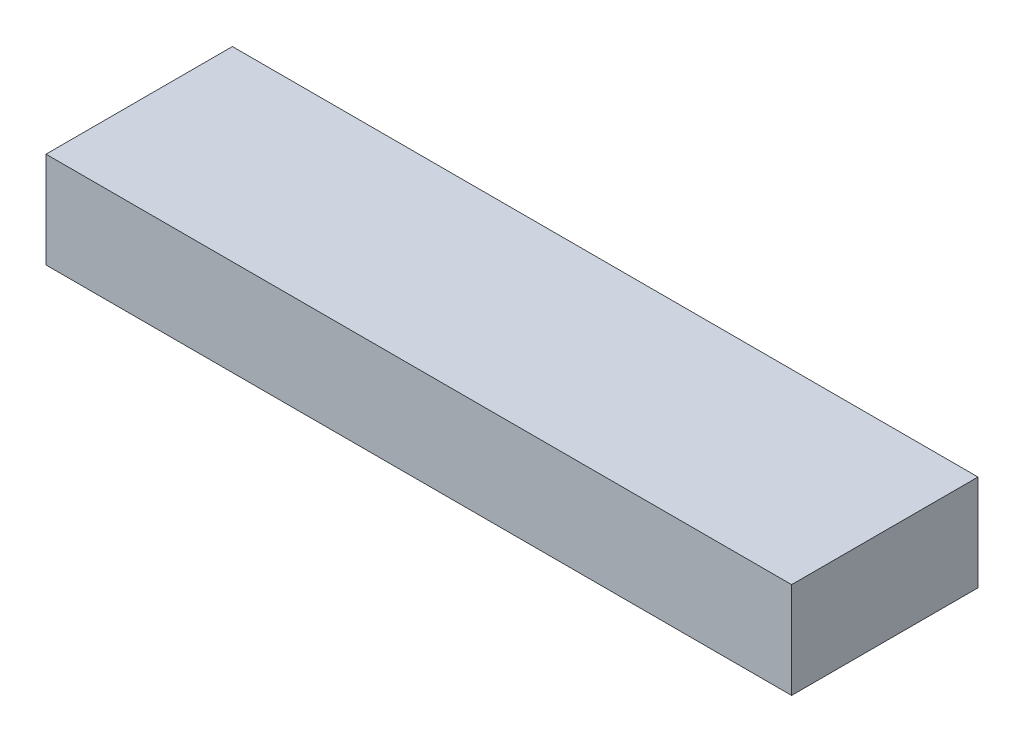
ISO-10303-21;
HEADER;
FILE_DESCRIPTION(('STEP AP214'),'2;1');
FILE_NAME('part.step','',(''),(''),'','','');
FILE_SCHEMA(('AUTOMOTIVE_DESIGN { 1 0 10303 214 1 1 1 1 }'));
ENDSEC;
DATA;
#1=APPLICATION_CONTEXT('core data for automotive mechanical design processes');
#2=APPLICATION_PROTOCOL_DEFINITION('international standard','automotive_design',2000,#1);
#3=PRODUCT_CONTEXT('',#1,'mechanical');
#4=PRODUCT('Part','Part','',(#3));
#5=PRODUCT_RELATED_PRODUCT_CATEGORY('part','',(#4));
#6=PRODUCT_DEFINITION_FORMATION('','',#4);
#7=PRODUCT_DEFINITION_CONTEXT('part definition',#1,'design');
#8=PRODUCT_DEFINITION('design','',#6,#7);
#9=PRODUCT_DEFINITION_SHAPE('','',#8);
#10=(LENGTH_UNIT() NAMED_UNIT(*) SI_UNIT(.MILLI.,.METRE.));
#11=(NAMED_UNIT(*) PLANE_ANGLE_UNIT() SI_UNIT($,.RADIAN.));
#12=(NAMED_UNIT(*) SI_UNIT($,.STERADIAN.) SOLID_ANGLE_UNIT());
#13=UNCERTAINTY_MEASURE_WITH_UNIT(LENGTH_MEASURE(1.E-05),#10,'distance_accuracy_value','');
#14=(GEOMETRIC_REPRESENTATION_CONTEXT(3) GLOBAL_UNCERTAINTY_ASSIGNED_CONTEXT((#13)) GLOBAL_UNIT_ASSIGNED_CONTEXT((#10,
#11,#12)) REPRESENTATION_CONTEXT('',''));
#15=CARTESIAN_POINT('',(0.,0.,0.));
#16=DIRECTION('',(0.,0.,1.));
#17=DIRECTION('',(1.,0.,0.));
#18=AXIS2_PLACEMENT_3D('',#15,#16,#17);
#19=CARTESIAN_POINT('',(8000.,-60.,2000.));
#20=DIRECTION('',(1.,0.,0.));
#21=DIRECTION('',(0.,0.,-1.));
#22=AXIS2_PLACEMENT_3D('',#19,#20,#21);
#23=PLANE('',#22);
#24=DIRECTION('',(0.,1.,0.));
#25=VECTOR('',#24,1.);
#26=CARTESIAN_POINT('',(8000.,-60.,-2000.));
#27=LINE('',#26,#25);
#28=CARTESIAN_POINT('',(8000.,-60.,-2000.));
#29=VERTEX_POINT('',#28);
#30=CARTESIAN_POINT('',(8000.,2000.,-2000.));
#31=VERTEX_POINT('',#30);
#32=EDGE_CURVE('E46',#29,#31,#27,.T.);
#33=ORIENTED_EDGE('',*,*,#32,.T.);
#34=DIRECTION('',(0.,0.,-1.));
#35=VECTOR('',#34,1.);
#36=CARTESIAN_POINT('',(8000.,2000.,2000.));
#37=LINE('',#36,#35);
#38=CARTESIAN_POINT('',(8000.,2000.,2000.));
#39=VERTEX_POINT('',#38);
#40=EDGE_CURVE('E84',#39,#31,#37,.T.);
#41=ORIENTED_EDGE('',*,*,#40,.F.);
#42=DIRECTION('',(0.,1.,0.));
#43=VECTOR('',#42,1.);
#44=CARTESIAN_POINT('',(8000.,-60.,2000.));
#45=LINE('',#44,#43);
#46=CARTESIAN_POINT('',(8000.,-60.,2000.));
#47=VERTEX_POINT('',#46);
#48=EDGE_CURVE('E11',#47,#39,#45,.T.);
#49=ORIENTED_EDGE('',*,*,#48,.F.);
#50=DIRECTION('',(0.,0.,-1.));
#51=VECTOR('',#50,1.);
#52=CARTESIAN_POINT('',(8000.,-60.,2000.));
#53=LINE('',#52,#51);
#54=EDGE_CURVE('E85',#47,#29,#53,.T.);
#55=ORIENTED_EDGE('',*,*,#54,.T.);
#56=EDGE_LOOP('',(#33,#41,#49,#55));
#57=FACE_BOUND('',#56,.T.);
#58=ADVANCED_FACE('F43',(#57),#23,.T.);
#59=CARTESIAN_POINT('',(-8000.,-60.,2000.));
#60=DIRECTION('',(0.,0.,1.));
#61=DIRECTION('',(1.,0.,0.));
#62=AXIS2_PLACEMENT_3D('',#59,#60,#61);
#63=PLANE('',#62);
#64=ORIENTED_EDGE('',*,*,#48,.T.);
#65=DIRECTION('',(1.,0.,0.));
#66=VECTOR('',#65,1.);
#67=CARTESIAN_POINT('',(-8000.,2000.,2000.));
#68=LINE('',#67,#66);
#69=CARTESIAN_POINT('',(-8000.,2000.,2000.));
#70=VERTEX_POINT('',#69);
#71=EDGE_CURVE('E103',#70,#39,#68,.T.);
#72=ORIENTED_EDGE('',*,*,#71,.F.);
#73=DIRECTION('',(0.,1.,0.));
#74=VECTOR('',#73,1.);
#75=CARTESIAN_POINT('',(-8000.,-60.,2000.));
#76=LINE('',#75,#74);
#77=CARTESIAN_POINT('',(-8000.,-60.,2000.));
#78=VERTEX_POINT('',#77);
#79=EDGE_CURVE('E52',#78,#70,#76,.T.);
#80=ORIENTED_EDGE('',*,*,#79,.F.);
#81=DIRECTION('',(1.,0.,0.));
#82=VECTOR('',#81,1.);
#83=CARTESIAN_POINT('',(-8000.,-60.,2000.));
#84=LINE('',#83,#82);
#85=EDGE_CURVE('E91',#78,#47,#84,.T.);
#86=ORIENTED_EDGE('',*,*,#85,.T.);
#87=EDGE_LOOP('',(#64,#72,#80,#86));
#88=FACE_BOUND('',#87,.T.);
#89=ADVANCED_FACE('F127',(#88),#63,.T.);
#90=CARTESIAN_POINT('',(-8000.,-60.,2000.));
#91=DIRECTION('',(-1.,0.,0.));
#92=DIRECTION('',(0.,0.,1.));
#93=AXIS2_PLACEMENT_3D('',#90,#91,#92);
#94=PLANE('',#93);
#95=ORIENTED_EDGE('',*,*,#79,.T.);
#96=DIRECTION('',(0.,0.,1.));
#97=VECTOR('',#96,1.);
#98=CARTESIAN_POINT('',(-8000.,2000.,2000.));
#99=LINE('',#98,#97);
#100=CARTESIAN_POINT('',(-8000.,2000.,-2000.));
#101=VERTEX_POINT('',#100);
#102=EDGE_CURVE('E99',#101,#70,#99,.T.);
#103=ORIENTED_EDGE('',*,*,#102,.F.);
#104=DIRECTION('',(0.,1.,0.));
#105=VECTOR('',#104,1.);
#106=CARTESIAN_POINT('',(-8000.,-60.,-2000.));
#107=LINE('',#106,#105);
#108=CARTESIAN_POINT('',(-8000.,-60.,-2000.));
#109=VERTEX_POINT('',#108);
#110=EDGE_CURVE('E90',#109,#101,#107,.T.);
#111=ORIENTED_EDGE('',*,*,#110,.F.);
#112=DIRECTION('',(0.,0.,1.));
#113=VECTOR('',#112,1.);
#114=CARTESIAN_POINT('',(-8000.,-60.,2000.));
#115=LINE('',#114,#113);
#116=EDGE_CURVE('E116',#109,#78,#115,.T.);
#117=ORIENTED_EDGE('',*,*,#116,.T.);
#118=EDGE_LOOP('',(#95,#103,#111,#117));
#119=FACE_BOUND('',#118,.T.);
#120=ADVANCED_FACE('F124',(#119),#94,.T.);
#121=CARTESIAN_POINT('',(-8000.,-60.,-2000.));
#122=DIRECTION('',(0.,0.,-1.));
#123=DIRECTION('',(-1.,0.,0.));
#124=AXIS2_PLACEMENT_3D('',#121,#122,#123);
#125=PLANE('',#124);
#126=ORIENTED_EDGE('',*,*,#110,.T.);
#127=DIRECTION('',(-1.,0.,0.));
#128=VECTOR('',#127,1.);
#129=CARTESIAN_POINT('',(-8000.,2000.,-2000.));
#130=LINE('',#129,#128);
#131=EDGE_CURVE('E93',#31,#101,#130,.T.);
#132=ORIENTED_EDGE('',*,*,#131,.F.);
#133=ORIENTED_EDGE('',*,*,#32,.F.);
#134=DIRECTION('',(-1.,0.,0.));
#135=VECTOR('',#134,1.);
#136=CARTESIAN_POINT('',(-8000.,-60.,-2000.));
#137=LINE('',#136,#135);
#138=EDGE_CURVE('E113',#29,#109,#137,.T.);
#139=ORIENTED_EDGE('',*,*,#138,.T.);
#140=EDGE_LOOP('',(#126,#132,#133,#139));
#141=FACE_BOUND('',#140,.T.);
#142=ADVANCED_FACE('F94',(#141),#125,.T.);
#143=CARTESIAN_POINT('',(0.,-60.,0.));
#144=DIRECTION('',(0.,-1.,0.));
#145=DIRECTION('',(0.,0.,-1.));
#146=AXIS2_PLACEMENT_3D('',#143,#144,#145);
#147=PLANE('',#146);
#148=ORIENTED_EDGE('',*,*,#54,.F.);
#149=ORIENTED_EDGE('',*,*,#85,.F.);
#150=ORIENTED_EDGE('',*,*,#116,.F.);
#151=ORIENTED_EDGE('',*,*,#138,.F.);
#152=EDGE_LOOP('',(#148,#149,#150,#151));
#153=FACE_BOUND('',#152,.T.);
#154=ADVANCED_FACE('F129',(#153),#147,.T.);
#155=CARTESIAN_POINT('',(0.,2000.,0.));
#156=DIRECTION('',(0.,-1.,0.));
#157=DIRECTION('',(0.,0.,-1.));
#158=AXIS2_PLACEMENT_3D('',#155,#156,#157);
#159=PLANE('',#158);
#160=ORIENTED_EDGE('',*,*,#40,.T.);
#161=ORIENTED_EDGE('',*,*,#131,.T.);
#162=ORIENTED_EDGE('',*,*,#102,.T.);
#163=ORIENTED_EDGE('',*,*,#71,.T.);
#164=EDGE_LOOP('',(#160,#161,#162,#163));
#165=FACE_BOUND('',#164,.T.);
#166=ADVANCED_FACE('F102',(#165),#159,.F.);
#167=CLOSED_SHELL('',(#58,#89,#120,#142,#154,#166));
#168=MANIFOLD_SOLID_BREP('B2',#167);
#169=ADVANCED_BREP_SHAPE_REPRESENTATION('',(#18,#168),#14);
#170=SHAPE_DEFINITION_REPRESENTATION(#9,#169);
ENDSEC;
END-ISO-10303-21;
